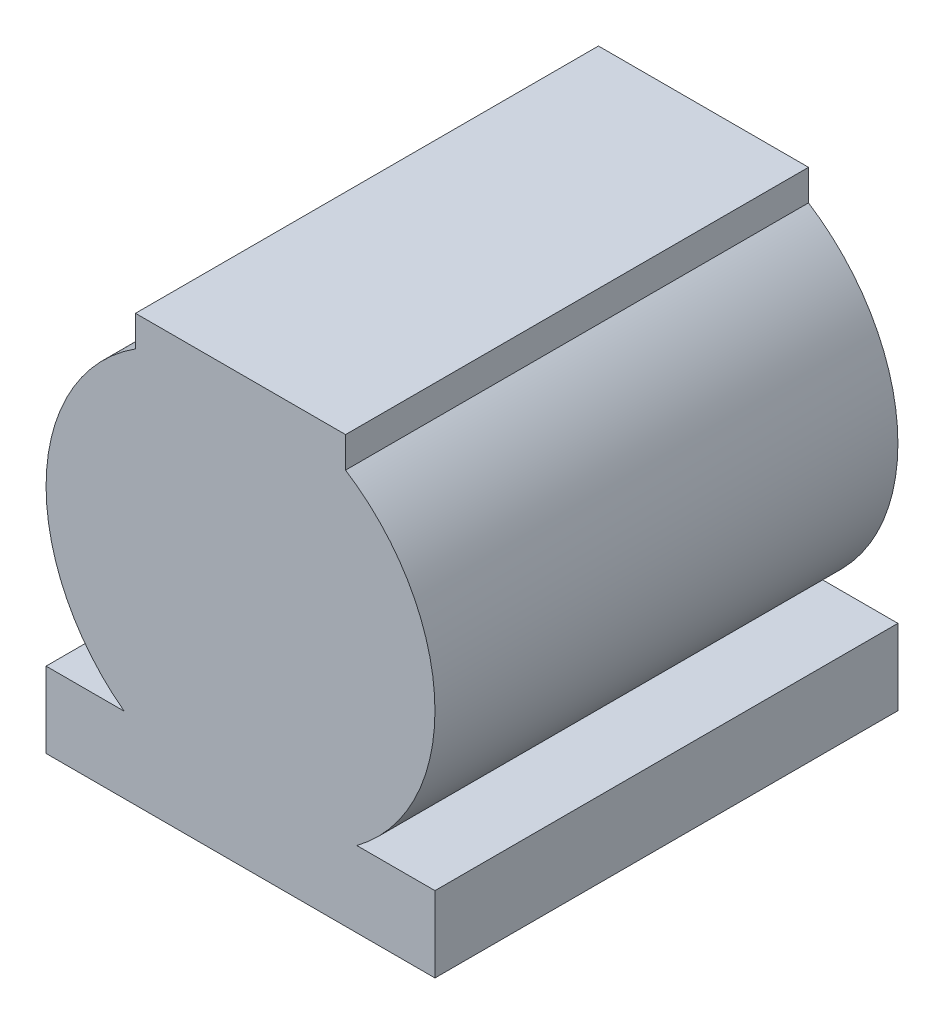
ISO-10303-21;
HEADER;
FILE_DESCRIPTION(('STEP AP214'),'2;1');
FILE_NAME('part.step','',(''),(''),'','','');
FILE_SCHEMA(('AUTOMOTIVE_DESIGN { 1 0 10303 214 1 1 1 1 }'));
ENDSEC;
DATA;
#1=APPLICATION_CONTEXT('core data for automotive mechanical design processes');
#2=APPLICATION_PROTOCOL_DEFINITION('international standard','automotive_design',2000,#1);
#3=PRODUCT_CONTEXT('',#1,'mechanical');
#4=PRODUCT('Part','Part','',(#3));
#5=PRODUCT_RELATED_PRODUCT_CATEGORY('part','',(#4));
#6=PRODUCT_DEFINITION_FORMATION('','',#4);
#7=PRODUCT_DEFINITION_CONTEXT('part definition',#1,'design');
#8=PRODUCT_DEFINITION('design','',#6,#7);
#9=PRODUCT_DEFINITION_SHAPE('','',#8);
#10=(LENGTH_UNIT() NAMED_UNIT(*) SI_UNIT(.MILLI.,.METRE.));
#11=(NAMED_UNIT(*) PLANE_ANGLE_UNIT() SI_UNIT($,.RADIAN.));
#12=(NAMED_UNIT(*) SI_UNIT($,.STERADIAN.) SOLID_ANGLE_UNIT());
#13=UNCERTAINTY_MEASURE_WITH_UNIT(LENGTH_MEASURE(1.E-05),#10,'distance_accuracy_value','');
#14=(GEOMETRIC_REPRESENTATION_CONTEXT(3) GLOBAL_UNCERTAINTY_ASSIGNED_CONTEXT((#13)) GLOBAL_UNIT_ASSIGNED_CONTEXT((#10,
#11,#12)) REPRESENTATION_CONTEXT('',''));
#15=CARTESIAN_POINT('',(0.,0.,0.));
#16=DIRECTION('',(0.,0.,1.));
#17=DIRECTION('',(1.,0.,0.));
#18=AXIS2_PLACEMENT_3D('',#15,#16,#17);
#19=CARTESIAN_POINT('',(-52.5,115.,62.5));
#20=DIRECTION('',(1.,0.,0.));
#21=DIRECTION('',(0.,0.,-1.));
#22=AXIS2_PLACEMENT_3D('',#19,#20,#21);
#23=PLANE('',#22);
#24=DIRECTION('',(0.,0.,1.));
#25=VECTOR('',#24,1.);
#26=CARTESIAN_POINT('',(-52.5,20.4315762203893,-62.5));
#27=LINE('',#26,#25);
#28=CARTESIAN_POINT('',(-52.5,20.4315762203893,-62.5));
#29=VERTEX_POINT('',#28);
#30=CARTESIAN_POINT('',(-52.5,20.4315762203893,62.5));
#31=VERTEX_POINT('',#30);
#32=EDGE_CURVE('E205',#29,#31,#27,.T.);
#33=ORIENTED_EDGE('',*,*,#32,.F.);
#34=DIRECTION('',(0.,-1.,0.));
#35=VECTOR('',#34,1.);
#36=CARTESIAN_POINT('',(-52.5,115.,-62.5));
#37=LINE('',#36,#35);
#38=CARTESIAN_POINT('',(-52.5,0.,-62.5));
#39=VERTEX_POINT('',#38);
#40=EDGE_CURVE('E199',#29,#39,#37,.T.);
#41=ORIENTED_EDGE('',*,*,#40,.T.);
#42=DIRECTION('',(0.,0.,1.));
#43=VECTOR('',#42,1.);
#44=CARTESIAN_POINT('',(-52.5,0.,62.5));
#45=LINE('',#44,#43);
#46=CARTESIAN_POINT('',(-52.5,0.,62.5));
#47=VERTEX_POINT('',#46);
#48=EDGE_CURVE('E203',#39,#47,#45,.T.);
#49=ORIENTED_EDGE('',*,*,#48,.T.);
#50=DIRECTION('',(0.,-1.,0.));
#51=VECTOR('',#50,1.);
#52=CARTESIAN_POINT('',(-52.5,115.,62.5));
#53=LINE('',#52,#51);
#54=EDGE_CURVE('E12',#31,#47,#53,.T.);
#55=ORIENTED_EDGE('',*,*,#54,.F.);
#56=EDGE_LOOP('',(#33,#41,#49,#55));
#57=FACE_BOUND('',#56,.T.);
#58=ADVANCED_FACE('F119',(#57),#23,.F.);
#59=CARTESIAN_POINT('',(52.5,115.,62.5));
#60=DIRECTION('',(0.,0.,-1.));
#61=DIRECTION('',(-1.,0.,0.));
#62=AXIS2_PLACEMENT_3D('',#59,#60,#61);
#63=PLANE('',#62);
#64=CARTESIAN_POINT('',(0.,62.5,62.5));
#65=DIRECTION('',(0.,0.,1.));
#66=DIRECTION('',(1.,0.,0.));
#67=AXIS2_PLACEMENT_3D('',#64,#65,#66);
#68=CIRCLE('',#67,52.5);
#69=CARTESIAN_POINT('',(-28.3609553272803,106.680382670638,62.5));
#70=VERTEX_POINT('',#69);
#71=CARTESIAN_POINT('',(-31.4085612643923,20.4315762203893,62.5));
#72=VERTEX_POINT('',#71);
#73=EDGE_CURVE('E122',#70,#72,#68,.T.);
#74=ORIENTED_EDGE('',*,*,#73,.T.);
#75=DIRECTION('',(1.,0.,0.));
#76=VECTOR('',#75,1.);
#77=CARTESIAN_POINT('',(52.5,20.4315762203892,62.5));
#78=LINE('',#77,#76);
#79=EDGE_CURVE('E266',#31,#72,#78,.T.);
#80=ORIENTED_EDGE('',*,*,#79,.F.);
#81=ORIENTED_EDGE('',*,*,#54,.T.);
#82=DIRECTION('',(1.,0.,0.));
#83=VECTOR('',#82,1.);
#84=CARTESIAN_POINT('',(52.5,0.,62.5));
#85=LINE('',#84,#83);
#86=CARTESIAN_POINT('',(52.5,0.,62.5));
#87=VERTEX_POINT('',#86);
#88=EDGE_CURVE('E223',#47,#87,#85,.T.);
#89=ORIENTED_EDGE('',*,*,#88,.T.);
#90=DIRECTION('',(0.,-1.,0.));
#91=VECTOR('',#90,1.);
#92=CARTESIAN_POINT('',(52.5,115.,62.5));
#93=LINE('',#92,#91);
#94=CARTESIAN_POINT('',(52.5,20.4315762203893,62.5));
#95=VERTEX_POINT('',#94);
#96=EDGE_CURVE('E128',#95,#87,#93,.T.);
#97=ORIENTED_EDGE('',*,*,#96,.F.);
#98=DIRECTION('',(-1.,0.,0.));
#99=VECTOR('',#98,1.);
#100=CARTESIAN_POINT('',(52.5,20.4315762203893,62.5));
#101=LINE('',#100,#99);
#102=CARTESIAN_POINT('',(31.4085612643923,20.4315762203893,62.5));
#103=VERTEX_POINT('',#102);
#104=EDGE_CURVE('E313',#95,#103,#101,.T.);
#105=ORIENTED_EDGE('',*,*,#104,.T.);
#106=CARTESIAN_POINT('',(0.,62.5,62.5));
#107=DIRECTION('',(0.,0.,1.));
#108=DIRECTION('',(1.,0.,0.));
#109=AXIS2_PLACEMENT_3D('',#106,#107,#108);
#110=CIRCLE('',#109,52.5);
#111=CARTESIAN_POINT('',(28.3609553272802,106.680382670638,62.5));
#112=VERTEX_POINT('',#111);
#113=EDGE_CURVE('E159',#103,#112,#110,.T.);
#114=ORIENTED_EDGE('',*,*,#113,.T.);
#115=DIRECTION('',(0.,1.,0.));
#116=VECTOR('',#115,1.);
#117=CARTESIAN_POINT('',(28.3609553272802,115.,62.5));
#118=LINE('',#117,#116);
#119=CARTESIAN_POINT('',(28.3609553272802,115.,62.5));
#120=VERTEX_POINT('',#119);
#121=EDGE_CURVE('E237',#112,#120,#118,.T.);
#122=ORIENTED_EDGE('',*,*,#121,.T.);
#123=DIRECTION('',(1.,0.,0.));
#124=VECTOR('',#123,1.);
#125=CARTESIAN_POINT('',(52.5,115.,62.5));
#126=LINE('',#125,#124);
#127=CARTESIAN_POINT('',(-28.3609553272803,115.,62.5));
#128=VERTEX_POINT('',#127);
#129=EDGE_CURVE('E217',#128,#120,#126,.T.);
#130=ORIENTED_EDGE('',*,*,#129,.F.);
#131=DIRECTION('',(0.,-1.,0.));
#132=VECTOR('',#131,1.);
#133=CARTESIAN_POINT('',(-28.3609553272803,115.,62.5));
#134=LINE('',#133,#132);
#135=EDGE_CURVE('E232',#128,#70,#134,.T.);
#136=ORIENTED_EDGE('',*,*,#135,.T.);
#137=EDGE_LOOP('',(#74,#80,#81,#89,#97,#105,#114,#122,#130,#136));
#138=FACE_BOUND('',#137,.T.);
#139=ADVANCED_FACE('F270',(#138),#63,.F.);
#140=CARTESIAN_POINT('',(52.5,115.,-62.5));
#141=DIRECTION('',(0.,0.,1.));
#142=DIRECTION('',(1.,0.,0.));
#143=AXIS2_PLACEMENT_3D('',#140,#141,#142);
#144=PLANE('',#143);
#145=DIRECTION('',(-1.,0.,0.));
#146=VECTOR('',#145,1.);
#147=CARTESIAN_POINT('',(0.,20.4315762203892,-62.5));
#148=LINE('',#147,#146);
#149=CARTESIAN_POINT('',(-31.4085612643923,20.4315762203892,-62.5));
#150=VERTEX_POINT('',#149);
#151=EDGE_CURVE('E316',#150,#29,#148,.T.);
#152=ORIENTED_EDGE('',*,*,#151,.F.);
#153=CARTESIAN_POINT('',(0.,62.5,-62.5));
#154=DIRECTION('',(0.,0.,1.));
#155=DIRECTION('',(1.,0.,0.));
#156=AXIS2_PLACEMENT_3D('',#153,#154,#155);
#157=CIRCLE('',#156,52.5);
#158=CARTESIAN_POINT('',(-28.3609553272803,106.680382670638,-62.5));
#159=VERTEX_POINT('',#158);
#160=EDGE_CURVE('E255',#159,#150,#157,.T.);
#161=ORIENTED_EDGE('',*,*,#160,.F.);
#162=DIRECTION('',(0.,1.,0.));
#163=VECTOR('',#162,1.);
#164=CARTESIAN_POINT('',(-28.3609553272805,0.,-62.5));
#165=LINE('',#164,#163);
#166=CARTESIAN_POINT('',(-28.3609553272803,115.,-62.5));
#167=VERTEX_POINT('',#166);
#168=EDGE_CURVE('E253',#159,#167,#165,.T.);
#169=ORIENTED_EDGE('',*,*,#168,.T.);
#170=DIRECTION('',(-1.,0.,0.));
#171=VECTOR('',#170,1.);
#172=CARTESIAN_POINT('',(52.5,115.,-62.5));
#173=LINE('',#172,#171);
#174=CARTESIAN_POINT('',(28.3609553272802,115.,-62.5));
#175=VERTEX_POINT('',#174);
#176=EDGE_CURVE('E208',#175,#167,#173,.T.);
#177=ORIENTED_EDGE('',*,*,#176,.F.);
#178=DIRECTION('',(0.,-1.,0.));
#179=VECTOR('',#178,1.);
#180=CARTESIAN_POINT('',(28.3609553272802,0.,-62.5));
#181=LINE('',#180,#179);
#182=CARTESIAN_POINT('',(28.3609553272802,106.680382670638,-62.5));
#183=VERTEX_POINT('',#182);
#184=EDGE_CURVE('E137',#175,#183,#181,.T.);
#185=ORIENTED_EDGE('',*,*,#184,.T.);
#186=CARTESIAN_POINT('',(0.,62.5,-62.5));
#187=DIRECTION('',(0.,0.,1.));
#188=DIRECTION('',(1.,0.,0.));
#189=AXIS2_PLACEMENT_3D('',#186,#187,#188);
#190=CIRCLE('',#189,52.5);
#191=CARTESIAN_POINT('',(31.4085612643923,20.4315762203893,-62.5));
#192=VERTEX_POINT('',#191);
#193=EDGE_CURVE('E167',#192,#183,#190,.T.);
#194=ORIENTED_EDGE('',*,*,#193,.F.);
#195=DIRECTION('',(1.,0.,0.));
#196=VECTOR('',#195,1.);
#197=CARTESIAN_POINT('',(0.,20.4315762203892,-62.5));
#198=LINE('',#197,#196);
#199=CARTESIAN_POINT('',(52.5,20.4315762203893,-62.5));
#200=VERTEX_POINT('',#199);
#201=EDGE_CURVE('E320',#192,#200,#198,.T.);
#202=ORIENTED_EDGE('',*,*,#201,.T.);
#203=DIRECTION('',(0.,-1.,0.));
#204=VECTOR('',#203,1.);
#205=CARTESIAN_POINT('',(52.5,115.,-62.5));
#206=LINE('',#205,#204);
#207=CARTESIAN_POINT('',(52.5,0.,-62.5));
#208=VERTEX_POINT('',#207);
#209=EDGE_CURVE('E207',#200,#208,#206,.T.);
#210=ORIENTED_EDGE('',*,*,#209,.T.);
#211=DIRECTION('',(-1.,0.,0.));
#212=VECTOR('',#211,1.);
#213=CARTESIAN_POINT('',(52.5,0.,-62.5));
#214=LINE('',#213,#212);
#215=EDGE_CURVE('E211',#208,#39,#214,.T.);
#216=ORIENTED_EDGE('',*,*,#215,.T.);
#217=ORIENTED_EDGE('',*,*,#40,.F.);
#218=EDGE_LOOP('',(#152,#161,#169,#177,#185,#194,#202,#210,#216,#217));
#219=FACE_BOUND('',#218,.T.);
#220=ADVANCED_FACE('F212',(#219),#144,.F.);
#221=CARTESIAN_POINT('',(52.5,115.,62.5));
#222=DIRECTION('',(-1.,0.,0.));
#223=DIRECTION('',(0.,0.,1.));
#224=AXIS2_PLACEMENT_3D('',#221,#222,#223);
#225=PLANE('',#224);
#226=ORIENTED_EDGE('',*,*,#209,.F.);
#227=DIRECTION('',(0.,0.,1.));
#228=VECTOR('',#227,1.);
#229=CARTESIAN_POINT('',(52.5,20.4315762203893,-62.5));
#230=LINE('',#229,#228);
#231=EDGE_CURVE('E323',#200,#95,#230,.T.);
#232=ORIENTED_EDGE('',*,*,#231,.T.);
#233=ORIENTED_EDGE('',*,*,#96,.T.);
#234=DIRECTION('',(0.,0.,-1.));
#235=VECTOR('',#234,1.);
#236=CARTESIAN_POINT('',(52.5,0.,62.5));
#237=LINE('',#236,#235);
#238=EDGE_CURVE('E218',#87,#208,#237,.T.);
#239=ORIENTED_EDGE('',*,*,#238,.T.);
#240=EDGE_LOOP('',(#226,#232,#233,#239));
#241=FACE_BOUND('',#240,.T.);
#242=ADVANCED_FACE('F279',(#241),#225,.F.);
#243=CARTESIAN_POINT('',(0.,115.,0.));
#244=DIRECTION('',(0.,1.,0.));
#245=DIRECTION('',(0.,0.,1.));
#246=AXIS2_PLACEMENT_3D('',#243,#244,#245);
#247=PLANE('',#246);
#248=DIRECTION('',(0.,0.,1.));
#249=VECTOR('',#248,1.);
#250=CARTESIAN_POINT('',(-28.3609553272803,115.,-62.5));
#251=LINE('',#250,#249);
#252=EDGE_CURVE('E240',#167,#128,#251,.T.);
#253=ORIENTED_EDGE('',*,*,#252,.T.);
#254=ORIENTED_EDGE('',*,*,#129,.T.);
#255=DIRECTION('',(0.,0.,1.));
#256=VECTOR('',#255,1.);
#257=CARTESIAN_POINT('',(28.3609553272802,115.,-62.5));
#258=LINE('',#257,#256);
#259=EDGE_CURVE('E249',#175,#120,#258,.T.);
#260=ORIENTED_EDGE('',*,*,#259,.F.);
#261=ORIENTED_EDGE('',*,*,#176,.T.);
#262=EDGE_LOOP('',(#253,#254,#260,#261));
#263=FACE_BOUND('',#262,.T.);
#264=ADVANCED_FACE('F248',(#263),#247,.T.);
#265=CARTESIAN_POINT('',(0.,0.,0.));
#266=DIRECTION('',(0.,1.,0.));
#267=DIRECTION('',(0.,0.,1.));
#268=AXIS2_PLACEMENT_3D('',#265,#266,#267);
#269=PLANE('',#268);
#270=ORIENTED_EDGE('',*,*,#48,.F.);
#271=ORIENTED_EDGE('',*,*,#215,.F.);
#272=ORIENTED_EDGE('',*,*,#238,.F.);
#273=ORIENTED_EDGE('',*,*,#88,.F.);
#274=EDGE_LOOP('',(#270,#271,#272,#273));
#275=FACE_BOUND('',#274,.T.);
#276=ADVANCED_FACE('F221',(#275),#269,.F.);
#277=CARTESIAN_POINT('',(0.,62.5,-62.5));
#278=DIRECTION('',(0.,0.,1.));
#279=DIRECTION('',(1.,0.,0.));
#280=AXIS2_PLACEMENT_3D('',#277,#278,#279);
#281=CYLINDRICAL_SURFACE('',#280,52.5);
#282=ORIENTED_EDGE('',*,*,#113,.F.);
#283=DIRECTION('',(0.,0.,1.));
#284=VECTOR('',#283,1.);
#285=CARTESIAN_POINT('',(31.4085612643923,20.4315762203893,-62.5));
#286=LINE('',#285,#284);
#287=EDGE_CURVE('E322',#192,#103,#286,.T.);
#288=ORIENTED_EDGE('',*,*,#287,.F.);
#289=ORIENTED_EDGE('',*,*,#193,.T.);
#290=DIRECTION('',(0.,0.,1.));
#291=VECTOR('',#290,1.);
#292=CARTESIAN_POINT('',(28.3609553272802,106.680382670638,-62.5));
#293=LINE('',#292,#291);
#294=EDGE_CURVE('E260',#183,#112,#293,.T.);
#295=ORIENTED_EDGE('',*,*,#294,.T.);
#296=EDGE_LOOP('',(#282,#288,#289,#295));
#297=FACE_BOUND('',#296,.T.);
#298=ADVANCED_FACE('F268',(#297),#281,.T.);
#299=CARTESIAN_POINT('',(28.3609553272802,0.,-62.5));
#300=DIRECTION('',(-1.,0.,0.));
#301=DIRECTION('',(0.,0.,1.));
#302=AXIS2_PLACEMENT_3D('',#299,#300,#301);
#303=PLANE('',#302);
#304=ORIENTED_EDGE('',*,*,#294,.F.);
#305=ORIENTED_EDGE('',*,*,#184,.F.);
#306=ORIENTED_EDGE('',*,*,#259,.T.);
#307=ORIENTED_EDGE('',*,*,#121,.F.);
#308=EDGE_LOOP('',(#304,#305,#306,#307));
#309=FACE_BOUND('',#308,.T.);
#310=ADVANCED_FACE('F269',(#309),#303,.F.);
#311=CARTESIAN_POINT('',(0.,62.5,-62.5));
#312=DIRECTION('',(0.,0.,1.));
#313=DIRECTION('',(1.,0.,0.));
#314=AXIS2_PLACEMENT_3D('',#311,#312,#313);
#315=CYLINDRICAL_SURFACE('',#314,52.5);
#316=ORIENTED_EDGE('',*,*,#73,.F.);
#317=DIRECTION('',(0.,0.,1.));
#318=VECTOR('',#317,1.);
#319=CARTESIAN_POINT('',(-28.3609553272803,106.680382670638,-62.5));
#320=LINE('',#319,#318);
#321=EDGE_CURVE('E257',#159,#70,#320,.T.);
#322=ORIENTED_EDGE('',*,*,#321,.F.);
#323=ORIENTED_EDGE('',*,*,#160,.T.);
#324=DIRECTION('',(0.,0.,1.));
#325=VECTOR('',#324,1.);
#326=CARTESIAN_POINT('',(-31.4085612643923,20.4315762203892,-62.5));
#327=LINE('',#326,#325);
#328=EDGE_CURVE('E312',#150,#72,#327,.T.);
#329=ORIENTED_EDGE('',*,*,#328,.T.);
#330=EDGE_LOOP('',(#316,#322,#323,#329));
#331=FACE_BOUND('',#330,.T.);
#332=ADVANCED_FACE('F293',(#331),#315,.T.);
#333=CARTESIAN_POINT('',(-28.3609553272805,0.,-62.5));
#334=DIRECTION('',(1.,0.,0.));
#335=DIRECTION('',(0.,1.,0.));
#336=AXIS2_PLACEMENT_3D('',#333,#334,#335);
#337=PLANE('',#336);
#338=ORIENTED_EDGE('',*,*,#252,.F.);
#339=ORIENTED_EDGE('',*,*,#168,.F.);
#340=ORIENTED_EDGE('',*,*,#321,.T.);
#341=ORIENTED_EDGE('',*,*,#135,.F.);
#342=EDGE_LOOP('',(#338,#339,#340,#341));
#343=FACE_BOUND('',#342,.T.);
#344=ADVANCED_FACE('F296',(#343),#337,.F.);
#345=CARTESIAN_POINT('',(0.,20.4315762203892,-62.5));
#346=DIRECTION('',(0.,1.,0.));
#347=DIRECTION('',(-1.,0.,0.));
#348=AXIS2_PLACEMENT_3D('',#345,#346,#347);
#349=PLANE('',#348);
#350=ORIENTED_EDGE('',*,*,#79,.T.);
#351=ORIENTED_EDGE('',*,*,#328,.F.);
#352=ORIENTED_EDGE('',*,*,#151,.T.);
#353=ORIENTED_EDGE('',*,*,#32,.T.);
#354=EDGE_LOOP('',(#350,#351,#352,#353));
#355=FACE_BOUND('',#354,.T.);
#356=ADVANCED_FACE('F300',(#355),#349,.T.);
#357=CARTESIAN_POINT('',(0.,20.4315762203892,-62.5));
#358=DIRECTION('',(0.,-1.,0.));
#359=DIRECTION('',(1.,0.,0.));
#360=AXIS2_PLACEMENT_3D('',#357,#358,#359);
#361=PLANE('',#360);
#362=ORIENTED_EDGE('',*,*,#231,.F.);
#363=ORIENTED_EDGE('',*,*,#201,.F.);
#364=ORIENTED_EDGE('',*,*,#287,.T.);
#365=ORIENTED_EDGE('',*,*,#104,.F.);
#366=EDGE_LOOP('',(#362,#363,#364,#365));
#367=FACE_BOUND('',#366,.T.);
#368=ADVANCED_FACE('F301',(#367),#361,.F.);
#369=CLOSED_SHELL('',(#58,#139,#220,#242,#264,#276,#298,#310,#332,#344,#356,#368));
#370=MANIFOLD_SOLID_BREP('B2',#369);
#371=ADVANCED_BREP_SHAPE_REPRESENTATION('',(#18,#370),#14);
#372=SHAPE_DEFINITION_REPRESENTATION(#9,#371);
ENDSEC;
END-ISO-10303-21;
